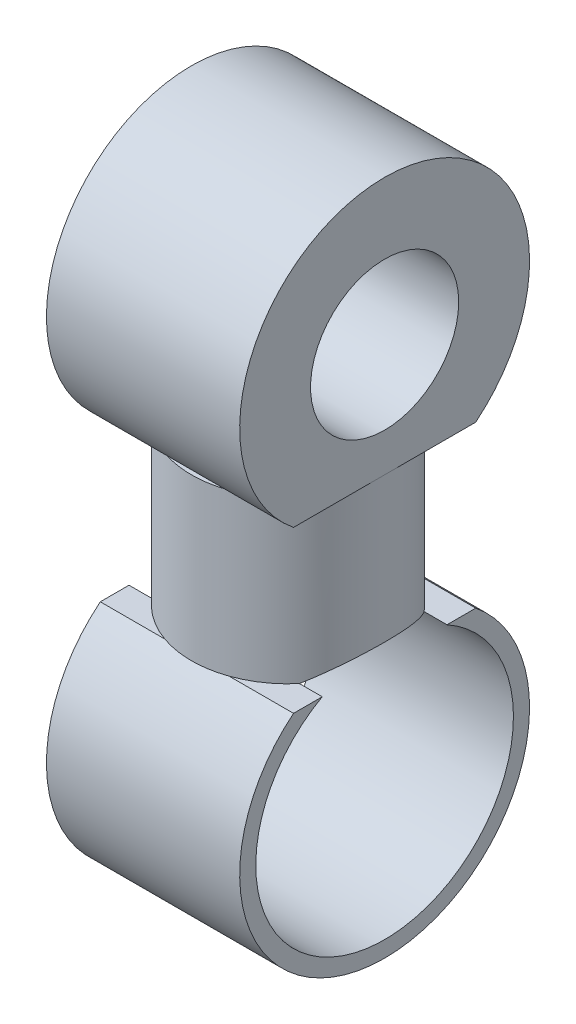
ISO-10303-21;
HEADER;
FILE_DESCRIPTION(('STEP AP214'),'2;1');
FILE_NAME('part.step','',(''),(''),'','','');
FILE_SCHEMA(('AUTOMOTIVE_DESIGN { 1 0 10303 214 1 1 1 1 }'));
ENDSEC;
DATA;
#1=APPLICATION_CONTEXT('core data for automotive mechanical design processes');
#2=APPLICATION_PROTOCOL_DEFINITION('international standard','automotive_design',2000,#1);
#3=PRODUCT_CONTEXT('',#1,'mechanical');
#4=PRODUCT('Part','Part','',(#3));
#5=PRODUCT_RELATED_PRODUCT_CATEGORY('part','',(#4));
#6=PRODUCT_DEFINITION_FORMATION('','',#4);
#7=PRODUCT_DEFINITION_CONTEXT('part definition',#1,'design');
#8=PRODUCT_DEFINITION('design','',#6,#7);
#9=PRODUCT_DEFINITION_SHAPE('','',#8);
#10=(LENGTH_UNIT() NAMED_UNIT(*) SI_UNIT(.MILLI.,.METRE.));
#11=(NAMED_UNIT(*) PLANE_ANGLE_UNIT() SI_UNIT($,.RADIAN.));
#12=(NAMED_UNIT(*) SI_UNIT($,.STERADIAN.) SOLID_ANGLE_UNIT());
#13=UNCERTAINTY_MEASURE_WITH_UNIT(LENGTH_MEASURE(1.E-05),#10,'distance_accuracy_value','');
#14=(GEOMETRIC_REPRESENTATION_CONTEXT(3) GLOBAL_UNCERTAINTY_ASSIGNED_CONTEXT((#13)) GLOBAL_UNIT_ASSIGNED_CONTEXT((#10,
#11,#12)) REPRESENTATION_CONTEXT('',''));
#15=CARTESIAN_POINT('',(0.,0.,0.));
#16=DIRECTION('',(0.,0.,1.));
#17=DIRECTION('',(1.,0.,0.));
#18=AXIS2_PLACEMENT_3D('',#15,#16,#17);
#19=CARTESIAN_POINT('',(0.,4.5,0.));
#20=DIRECTION('',(0.,-1.,0.));
#21=DIRECTION('',(0.,0.,-1.));
#22=AXIS2_PLACEMENT_3D('',#19,#20,#21);
#23=CYLINDRICAL_SURFACE('',#22,3.);
#24=CARTESIAN_POINT('',(0.,5.,0.));
#25=DIRECTION('',(0.,1.,0.));
#26=DIRECTION('',(0.,0.,1.));
#27=AXIS2_PLACEMENT_3D('',#24,#25,#26);
#28=CIRCLE('',#27,3.);
#29=CARTESIAN_POINT('',(-1.,5.,2.82842712474619));
#30=VERTEX_POINT('',#29);
#31=CARTESIAN_POINT('',(1.,5.,2.82842712474619));
#32=VERTEX_POINT('',#31);
#33=EDGE_CURVE('E275',#30,#32,#28,.T.);
#34=ORIENTED_EDGE('',*,*,#33,.F.);
#35=CARTESIAN_POINT('',(-3.,5.,0.));
#36=VERTEX_POINT('',#35);
#37=EDGE_CURVE('E274',#36,#30,#28,.T.);
#38=ORIENTED_EDGE('',*,*,#37,.F.);
#39=CARTESIAN_POINT('',(-0.999999999999999,5.,-2.82842712474619));
#40=VERTEX_POINT('',#39);
#41=EDGE_CURVE('E439',#40,#36,#28,.T.);
#42=ORIENTED_EDGE('',*,*,#41,.F.);
#43=CARTESIAN_POINT('',(0.999999999999999,5.,-2.82842712474619));
#44=VERTEX_POINT('',#43);
#45=EDGE_CURVE('E455',#44,#40,#28,.T.);
#46=ORIENTED_EDGE('',*,*,#45,.F.);
#47=CARTESIAN_POINT('',(3.,5.,0.));
#48=VERTEX_POINT('',#47);
#49=EDGE_CURVE('E452',#48,#44,#28,.T.);
#50=ORIENTED_EDGE('',*,*,#49,.F.);
#51=EDGE_CURVE('E280',#32,#48,#28,.T.);
#52=ORIENTED_EDGE('',*,*,#51,.F.);
#53=EDGE_LOOP('',(#34,#38,#42,#46,#50,#52));
#54=FACE_BOUND('',#53,.T.);
#55=CARTESIAN_POINT('',(0.,0.,0.));
#56=DIRECTION('',(0.,1.,0.));
#57=DIRECTION('',(0.,0.,1.));
#58=AXIS2_PLACEMENT_3D('',#55,#56,#57);
#59=CIRCLE('',#58,3.);
#60=CARTESIAN_POINT('',(-1.,0.,-2.82842712474619));
#61=VERTEX_POINT('',#60);
#62=CARTESIAN_POINT('',(-2.29128784747792,0.,-1.93649167310371));
#63=VERTEX_POINT('',#62);
#64=EDGE_CURVE('E375',#61,#63,#59,.T.);
#65=ORIENTED_EDGE('',*,*,#64,.T.);
#66=CARTESIAN_POINT('',(-2.29128784747792,0.,-1.93649167310371));
#67=CARTESIAN_POINT('',(-2.33960531215162,0.031637684202628,-1.87930069137875));
#68=CARTESIAN_POINT('',(-2.38597131135707,0.0625560228296738,-1.82011345106026));
#69=CARTESIAN_POINT('',(-2.47456837017257,0.122487190395126,-1.69772026656292));
#70=CARTESIAN_POINT('',(-2.51679564090104,0.151498265439313,-1.63451072578697));
#71=CARTESIAN_POINT('',(-2.63733345868187,0.235259035748146,-1.43809158975917));
#72=CARTESIAN_POINT('',(-2.7088400381469,0.286295652024037,-1.29886379495034));
#73=CARTESIAN_POINT('',(-2.80007305597204,0.352268852673703,-1.07978407452648));
#74=CARTESIAN_POINT('',(-2.82788241411722,0.372548958473154,-1.00476793971611));
#75=CARTESIAN_POINT('',(-2.87763310974862,0.409025907601418,-0.851866817398749));
#76=CARTESIAN_POINT('',(-2.89957788437755,0.425225142345652,-0.773983540869725));
#77=CARTESIAN_POINT('',(-2.93715260815061,0.453062923120266,-0.61618812070086));
#78=CARTESIAN_POINT('',(-2.95280354213411,0.464716620845895,-0.536283679439771));
#79=CARTESIAN_POINT('',(-2.97759668037431,0.483216871465038,-0.374953499743338));
#80=CARTESIAN_POINT('',(-2.9867400017866,0.490064249452066,-0.293528024886594));
#81=CARTESIAN_POINT('',(-3.00265802713564,0.501985739416292,-0.0682216055642268));
#82=CARTESIAN_POINT('',(-3.00246757367103,0.501844121811212,0.0765296087037328));
#83=CARTESIAN_POINT('',(-2.98136614380672,0.486038323811593,0.363622730617651));
#84=CARTESIAN_POINT('',(-2.96044575673277,0.470367093508772,0.505963514161905));
#85=CARTESIAN_POINT('',(-2.90094101757758,0.426205152013952,0.776301877948906));
#86=CARTESIAN_POINT('',(-2.86339567813845,0.398469984753027,0.904657470071963));
#87=CARTESIAN_POINT('',(-2.77276308620056,0.332395789663157,1.15294171807456));
#88=CARTESIAN_POINT('',(-2.71966111318218,0.294046720299558,1.27286225835994));
#89=CARTESIAN_POINT('',(-2.6077506418834,0.21470083465322,1.487385036329));
#90=CARTESIAN_POINT('',(-2.5506026890119,0.174710086605101,1.58324548346381));
#91=CARTESIAN_POINT('',(-2.4273823637667,0.0902974630640805,1.76633137546215));
#92=CARTESIAN_POINT('',(-2.36134643128432,0.0458938647540437,1.85358968213791));
#93=CARTESIAN_POINT('',(-2.29128784747792,0.,1.93649167310371));
#94=B_SPLINE_CURVE_WITH_KNOTS('',3,(#66,#67,#68,#69,#70,#71,#72,#73,#74,#75,#76,#77,#78,#79,#80,
#81,#82,#83,#84,#85,#86,#87,#88,#89,#90,#91,#92,#93),.UNSPECIFIED.,.F.,.F.,(4,2,2,2,2,2,2,2,2,2,
2,2,2,4),(0.,0.243702912554063,0.487626883775307,0.978764179619406,1.22608572911403,
1.47326200775075,1.71960718199239,1.96591005618742,2.39763691228655,2.82955984730584,
3.2376359542357,3.64609945879512,4.00101870034537,4.35452477848348),.UNSPECIFIED.);
#95=CARTESIAN_POINT('',(-2.29128784747792,0.,1.93649167310371));
#96=VERTEX_POINT('',#95);
#97=EDGE_CURVE('E253',#63,#96,#94,.T.);
#98=ORIENTED_EDGE('',*,*,#97,.T.);
#99=CARTESIAN_POINT('',(-1.,0.,2.82842712474619));
#100=VERTEX_POINT('',#99);
#101=EDGE_CURVE('E251',#96,#100,#59,.T.);
#102=ORIENTED_EDGE('',*,*,#101,.T.);
#103=CARTESIAN_POINT('',(0.,0.,0.));
#104=DIRECTION('',(0.,1.,0.));
#105=DIRECTION('',(0.,0.,1.));
#106=AXIS2_PLACEMENT_3D('',#103,#104,#105);
#107=CIRCLE('',#106,3.);
#108=CARTESIAN_POINT('',(1.,0.,2.82842712474619));
#109=VERTEX_POINT('',#108);
#110=EDGE_CURVE('E333',#100,#109,#107,.T.);
#111=ORIENTED_EDGE('',*,*,#110,.T.);
#112=CARTESIAN_POINT('',(2.29128784747792,0.,1.93649167310371));
#113=VERTEX_POINT('',#112);
#114=EDGE_CURVE('E267',#109,#113,#59,.T.);
#115=ORIENTED_EDGE('',*,*,#114,.T.);
#116=CARTESIAN_POINT('',(2.29128784747792,0.,1.93649167310371));
#117=CARTESIAN_POINT('',(2.33960531215162,0.0316376842026277,1.87930069137875));
#118=CARTESIAN_POINT('',(2.38597131135707,0.0625560228296734,1.82011345106026));
#119=CARTESIAN_POINT('',(2.47456837017257,0.122487190395126,1.69772026656292));
#120=CARTESIAN_POINT('',(2.51679564090104,0.151498265439312,1.63451072578697));
#121=CARTESIAN_POINT('',(2.63733345868187,0.235259035748145,1.43809158975917));
#122=CARTESIAN_POINT('',(2.7088400381469,0.286295652024036,1.29886379495034));
#123=CARTESIAN_POINT('',(2.80007305597204,0.352268852673702,1.07978407452648));
#124=CARTESIAN_POINT('',(2.82788241411722,0.372548958473153,1.00476793971611));
#125=CARTESIAN_POINT('',(2.87763310974862,0.409025907601417,0.851866817398749));
#126=CARTESIAN_POINT('',(2.89957788437755,0.425225142345652,0.773983540869725));
#127=CARTESIAN_POINT('',(2.93715260815061,0.453062923120266,0.61618812070086));
#128=CARTESIAN_POINT('',(2.95280354213411,0.464716620845894,0.536283679439771));
#129=CARTESIAN_POINT('',(2.97759668037431,0.483216871465037,0.374953499743338));
#130=CARTESIAN_POINT('',(2.9867400017866,0.490064249452066,0.293528024886594));
#131=CARTESIAN_POINT('',(3.00265802713564,0.501985739416293,0.068221605564227));
#132=CARTESIAN_POINT('',(3.00246757367103,0.501844121811212,-0.0765296087037324));
#133=CARTESIAN_POINT('',(2.98136614380672,0.486038323811593,-0.363622730617651));
#134=CARTESIAN_POINT('',(2.96044575673277,0.470367093508772,-0.505963514161905));
#135=CARTESIAN_POINT('',(2.90094101757758,0.426205152013952,-0.776301877948906));
#136=CARTESIAN_POINT('',(2.86339567813845,0.398469984753027,-0.904657470071963));
#137=CARTESIAN_POINT('',(2.77276308620056,0.332395789663157,-1.15294171807456));
#138=CARTESIAN_POINT('',(2.71966111318218,0.294046720299557,-1.27286225835994));
#139=CARTESIAN_POINT('',(2.6077506418834,0.21470083465322,-1.487385036329));
#140=CARTESIAN_POINT('',(2.5506026890119,0.174710086605101,-1.58324548346381));
#141=CARTESIAN_POINT('',(2.4273823637667,0.0902974630640802,-1.76633137546214));
#142=CARTESIAN_POINT('',(2.36134643128432,0.0458938647540435,-1.85358968213791));
#143=CARTESIAN_POINT('',(2.29128784747792,0.,-1.93649167310371));
#144=B_SPLINE_CURVE_WITH_KNOTS('',3,(#116,#117,#118,#119,#120,#121,#122,#123,#124,#125,#126,
#127,#128,#129,#130,#131,#132,#133,#134,#135,#136,#137,#138,#139,#140,#141,#142,#143),
.UNSPECIFIED.,.F.,.F.,(4,2,2,2,2,2,2,2,2,2,2,2,2,4),(0.,0.243702912554063,0.487626883775307,
0.978764179619406,1.22608572911403,1.47326200775075,1.71960718199238,1.96591005618742,
2.39763691228655,2.82955984730584,3.2376359542357,3.64609945879512,4.00101870034537,
4.35452477848348),.UNSPECIFIED.);
#145=CARTESIAN_POINT('',(2.29128784747792,0.,-1.93649167310371));
#146=VERTEX_POINT('',#145);
#147=EDGE_CURVE('E381',#113,#146,#144,.T.);
#148=ORIENTED_EDGE('',*,*,#147,.T.);
#149=CARTESIAN_POINT('',(1.,0.,-2.82842712474619));
#150=VERTEX_POINT('',#149);
#151=EDGE_CURVE('E269',#146,#150,#59,.T.);
#152=ORIENTED_EDGE('',*,*,#151,.T.);
#153=EDGE_CURVE('E371',#150,#61,#59,.T.);
#154=ORIENTED_EDGE('',*,*,#153,.T.);
#155=EDGE_LOOP('',(#65,#98,#102,#111,#115,#148,#152,#154));
#156=FACE_BOUND('',#155,.T.);
#157=ADVANCED_FACE('F143',(#54,#156),#23,.T.);
#158=CARTESIAN_POINT('',(0.,5.,0.));
#159=DIRECTION('',(0.,1.,0.));
#160=DIRECTION('',(0.,0.,1.));
#161=AXIS2_PLACEMENT_3D('',#158,#159,#160);
#162=PLANE('',#161);
#163=DIRECTION('',(1.,0.,0.));
#164=VECTOR('',#163,1.);
#165=CARTESIAN_POINT('',(-3.,5.,-2.82842712474619));
#166=LINE('',#165,#164);
#167=CARTESIAN_POINT('',(-3.,5.,-2.82842712474619));
#168=VERTEX_POINT('',#167);
#169=EDGE_CURVE('E309',#168,#40,#166,.T.);
#170=ORIENTED_EDGE('',*,*,#169,.T.);
#171=ORIENTED_EDGE('',*,*,#41,.T.);
#172=DIRECTION('',(0.,0.,1.));
#173=VECTOR('',#172,1.);
#174=CARTESIAN_POINT('',(-3.,5.,0.));
#175=LINE('',#174,#173);
#176=EDGE_CURVE('E287',#168,#36,#175,.T.);
#177=ORIENTED_EDGE('',*,*,#176,.F.);
#178=EDGE_LOOP('',(#170,#171,#177));
#179=FACE_BOUND('',#178,.T.);
#180=ADVANCED_FACE('F419',(#179),#162,.F.);
#181=DIRECTION('',(1.,0.,0.));
#182=VECTOR('',#181,1.);
#183=CARTESIAN_POINT('',(-3.,5.,2.82842712474619));
#184=LINE('',#183,#182);
#185=CARTESIAN_POINT('',(-3.,5.,2.82842712474619));
#186=VERTEX_POINT('',#185);
#187=EDGE_CURVE('E318',#186,#30,#184,.T.);
#188=ORIENTED_EDGE('',*,*,#187,.F.);
#189=EDGE_CURVE('E285',#36,#186,#175,.T.);
#190=ORIENTED_EDGE('',*,*,#189,.F.);
#191=ORIENTED_EDGE('',*,*,#37,.T.);
#192=EDGE_LOOP('',(#188,#190,#191));
#193=FACE_BOUND('',#192,.T.);
#194=ADVANCED_FACE('F424',(#193),#162,.F.);
#195=DIRECTION('',(1.,0.,0.));
#196=VECTOR('',#195,1.);
#197=CARTESIAN_POINT('',(-3.,5.,2.82842712474619));
#198=LINE('',#197,#196);
#199=CARTESIAN_POINT('',(3.,5.,2.82842712474619));
#200=VERTEX_POINT('',#199);
#201=EDGE_CURVE('E291',#200,#32,#198,.F.);
#202=ORIENTED_EDGE('',*,*,#201,.T.);
#203=ORIENTED_EDGE('',*,*,#51,.T.);
#204=DIRECTION('',(0.,0.,1.));
#205=VECTOR('',#204,1.);
#206=CARTESIAN_POINT('',(3.,5.,0.));
#207=LINE('',#206,#205);
#208=EDGE_CURVE('E286',#48,#200,#207,.T.);
#209=ORIENTED_EDGE('',*,*,#208,.T.);
#210=EDGE_LOOP('',(#202,#203,#209));
#211=FACE_BOUND('',#210,.T.);
#212=ADVANCED_FACE('F496',(#211),#162,.F.);
#213=CARTESIAN_POINT('',(3.,5.,-2.82842712474619));
#214=VERTEX_POINT('',#213);
#215=EDGE_CURVE('E281',#214,#48,#207,.T.);
#216=ORIENTED_EDGE('',*,*,#215,.T.);
#217=ORIENTED_EDGE('',*,*,#49,.T.);
#218=DIRECTION('',(1.,0.,0.));
#219=VECTOR('',#218,1.);
#220=CARTESIAN_POINT('',(-3.,5.,-2.82842712474619));
#221=LINE('',#220,#219);
#222=EDGE_CURVE('E279',#44,#214,#221,.T.);
#223=ORIENTED_EDGE('',*,*,#222,.T.);
#224=EDGE_LOOP('',(#216,#217,#223));
#225=FACE_BOUND('',#224,.T.);
#226=ADVANCED_FACE('F427',(#225),#162,.F.);
#227=CARTESIAN_POINT('',(-3.,8.5,0.));
#228=DIRECTION('',(1.,0.,0.));
#229=DIRECTION('',(0.,0.,-1.));
#230=AXIS2_PLACEMENT_3D('',#227,#228,#229);
#231=CYLINDRICAL_SURFACE('',#230,2.3);
#232=CARTESIAN_POINT('',(-3.,8.5,0.));
#233=DIRECTION('',(1.,0.,0.));
#234=DIRECTION('',(0.,0.,-1.));
#235=AXIS2_PLACEMENT_3D('',#232,#233,#234);
#236=CIRCLE('',#235,2.3);
#237=CARTESIAN_POINT('',(-3.,8.5,-2.3));
#238=VERTEX_POINT('',#237);
#239=EDGE_CURVE('E297',#238,#238,#236,.T.);
#240=ORIENTED_EDGE('',*,*,#239,.F.);
#241=EDGE_LOOP('',(#240));
#242=FACE_BOUND('',#241,.T.);
#243=CARTESIAN_POINT('',(3.,8.5,0.));
#244=DIRECTION('',(1.,0.,0.));
#245=DIRECTION('',(0.,0.,-1.));
#246=AXIS2_PLACEMENT_3D('',#243,#244,#245);
#247=CIRCLE('',#246,2.3);
#248=CARTESIAN_POINT('',(3.,8.5,-2.3));
#249=VERTEX_POINT('',#248);
#250=EDGE_CURVE('E296',#249,#249,#247,.T.);
#251=ORIENTED_EDGE('',*,*,#250,.T.);
#252=EDGE_LOOP('',(#251));
#253=FACE_BOUND('',#252,.T.);
#254=ADVANCED_FACE('F465',(#242,#253),#231,.F.);
#255=CARTESIAN_POINT('',(3.,5.,0.));
#256=DIRECTION('',(0.,1.,0.));
#257=DIRECTION('',(0.,0.,1.));
#258=AXIS2_PLACEMENT_3D('',#255,#256,#257);
#259=PLANE('',#258);
#260=ORIENTED_EDGE('',*,*,#45,.T.);
#261=EDGE_CURVE('E308',#40,#44,#166,.T.);
#262=ORIENTED_EDGE('',*,*,#261,.T.);
#263=EDGE_LOOP('',(#260,#262));
#264=FACE_BOUND('',#263,.T.);
#265=ADVANCED_FACE('F462',(#264),#259,.T.);
#266=CARTESIAN_POINT('',(3.,0.,0.));
#267=DIRECTION('',(1.,0.,0.));
#268=DIRECTION('',(0.,0.,-1.));
#269=AXIS2_PLACEMENT_3D('',#266,#267,#268);
#270=PLANE('',#269);
#271=ORIENTED_EDGE('',*,*,#215,.F.);
#272=CARTESIAN_POINT('',(3.,8.5,0.));
#273=DIRECTION('',(1.,0.,0.));
#274=DIRECTION('',(0.,0.,-1.));
#275=AXIS2_PLACEMENT_3D('',#272,#273,#274);
#276=CIRCLE('',#275,4.5);
#277=EDGE_CURVE('E301',#214,#200,#276,.T.);
#278=ORIENTED_EDGE('',*,*,#277,.T.);
#279=ORIENTED_EDGE('',*,*,#208,.F.);
#280=EDGE_LOOP('',(#271,#278,#279));
#281=FACE_BOUND('',#280,.T.);
#282=ORIENTED_EDGE('',*,*,#250,.F.);
#283=EDGE_LOOP('',(#282));
#284=FACE_BOUND('',#283,.T.);
#285=ADVANCED_FACE('F464',(#281,#284),#270,.T.);
#286=CARTESIAN_POINT('',(-3.,0.,0.));
#287=DIRECTION('',(1.,0.,0.));
#288=DIRECTION('',(0.,0.,-1.));
#289=AXIS2_PLACEMENT_3D('',#286,#287,#288);
#290=PLANE('',#289);
#291=ORIENTED_EDGE('',*,*,#239,.T.);
#292=EDGE_LOOP('',(#291));
#293=FACE_BOUND('',#292,.T.);
#294=CARTESIAN_POINT('',(-3.,8.5,0.));
#295=DIRECTION('',(1.,0.,0.));
#296=DIRECTION('',(0.,0.,-1.));
#297=AXIS2_PLACEMENT_3D('',#294,#295,#296);
#298=CIRCLE('',#297,4.5);
#299=EDGE_CURVE('E313',#168,#186,#298,.T.);
#300=ORIENTED_EDGE('',*,*,#299,.F.);
#301=ORIENTED_EDGE('',*,*,#176,.T.);
#302=ORIENTED_EDGE('',*,*,#189,.T.);
#303=EDGE_LOOP('',(#300,#301,#302));
#304=FACE_BOUND('',#303,.T.);
#305=ADVANCED_FACE('F447',(#293,#304),#290,.F.);
#306=CARTESIAN_POINT('',(-3.,8.5,0.));
#307=DIRECTION('',(1.,0.,0.));
#308=DIRECTION('',(0.,0.,-1.));
#309=AXIS2_PLACEMENT_3D('',#306,#307,#308);
#310=CYLINDRICAL_SURFACE('',#309,4.5);
#311=ORIENTED_EDGE('',*,*,#169,.F.);
#312=ORIENTED_EDGE('',*,*,#299,.T.);
#313=ORIENTED_EDGE('',*,*,#187,.T.);
#314=EDGE_CURVE('E317',#30,#32,#184,.T.);
#315=ORIENTED_EDGE('',*,*,#314,.T.);
#316=ORIENTED_EDGE('',*,*,#201,.F.);
#317=ORIENTED_EDGE('',*,*,#277,.F.);
#318=ORIENTED_EDGE('',*,*,#222,.F.);
#319=ORIENTED_EDGE('',*,*,#261,.F.);
#320=EDGE_LOOP('',(#311,#312,#313,#315,#316,#317,#318,#319));
#321=FACE_BOUND('',#320,.T.);
#322=ADVANCED_FACE('F414',(#321),#310,.T.);
#323=CARTESIAN_POINT('',(-3.,5.,0.));
#324=DIRECTION('',(0.,-1.,0.));
#325=DIRECTION('',(0.,0.,-1.));
#326=AXIS2_PLACEMENT_3D('',#323,#324,#325);
#327=PLANE('',#326);
#328=ORIENTED_EDGE('',*,*,#314,.F.);
#329=ORIENTED_EDGE('',*,*,#33,.T.);
#330=EDGE_LOOP('',(#328,#329));
#331=FACE_BOUND('',#330,.T.);
#332=ADVANCED_FACE('F409',(#331),#327,.F.);
#333=CARTESIAN_POINT('',(0.,0.,0.));
#334=DIRECTION('',(0.,-1.,0.));
#335=DIRECTION('',(0.,0.,-1.));
#336=AXIS2_PLACEMENT_3D('',#333,#334,#335);
#337=PLANE('',#336);
#338=DIRECTION('',(0.,0.,-1.));
#339=VECTOR('',#338,1.);
#340=CARTESIAN_POINT('',(-3.,0.,0.));
#341=LINE('',#340,#339);
#342=CARTESIAN_POINT('',(-3.,0.,-1.93649167310371));
#343=VERTEX_POINT('',#342);
#344=CARTESIAN_POINT('',(-3.,0.,-2.82842712474619));
#345=VERTEX_POINT('',#344);
#346=EDGE_CURVE('E261',#343,#345,#341,.T.);
#347=ORIENTED_EDGE('',*,*,#346,.F.);
#348=DIRECTION('',(1.,0.,0.));
#349=VECTOR('',#348,1.);
#350=CARTESIAN_POINT('',(-3.,0.,-1.93649167310371));
#351=LINE('',#350,#349);
#352=EDGE_CURVE('E159',#343,#63,#351,.T.);
#353=ORIENTED_EDGE('',*,*,#352,.T.);
#354=ORIENTED_EDGE('',*,*,#64,.F.);
#355=DIRECTION('',(1.,0.,0.));
#356=VECTOR('',#355,1.);
#357=CARTESIAN_POINT('',(-3.,0.,-2.82842712474619));
#358=LINE('',#357,#356);
#359=EDGE_CURVE('E323',#345,#61,#358,.T.);
#360=ORIENTED_EDGE('',*,*,#359,.F.);
#361=EDGE_LOOP('',(#347,#353,#354,#360));
#362=FACE_BOUND('',#361,.T.);
#363=ADVANCED_FACE('F394',(#362),#337,.F.);
#364=ORIENTED_EDGE('',*,*,#151,.F.);
#365=DIRECTION('',(1.,0.,0.));
#366=VECTOR('',#365,1.);
#367=CARTESIAN_POINT('',(-3.,0.,-1.93649167310371));
#368=LINE('',#367,#366);
#369=CARTESIAN_POINT('',(3.,0.,-1.93649167310371));
#370=VERTEX_POINT('',#369);
#371=EDGE_CURVE('E379',#146,#370,#368,.T.);
#372=ORIENTED_EDGE('',*,*,#371,.T.);
#373=DIRECTION('',(0.,0.,-1.));
#374=VECTOR('',#373,1.);
#375=CARTESIAN_POINT('',(3.,0.,0.));
#376=LINE('',#375,#374);
#377=CARTESIAN_POINT('',(3.,0.,-2.82842712474619));
#378=VERTEX_POINT('',#377);
#379=EDGE_CURVE('E336',#370,#378,#376,.T.);
#380=ORIENTED_EDGE('',*,*,#379,.T.);
#381=EDGE_CURVE('E322',#150,#378,#358,.T.);
#382=ORIENTED_EDGE('',*,*,#381,.F.);
#383=EDGE_LOOP('',(#364,#372,#380,#382));
#384=FACE_BOUND('',#383,.T.);
#385=ADVANCED_FACE('F408',(#384),#337,.F.);
#386=CARTESIAN_POINT('',(3.,0.,2.82842712474619));
#387=VERTEX_POINT('',#386);
#388=CARTESIAN_POINT('',(3.,0.,1.93649167310371));
#389=VERTEX_POINT('',#388);
#390=EDGE_CURVE('E152',#387,#389,#376,.T.);
#391=ORIENTED_EDGE('',*,*,#390,.T.);
#392=DIRECTION('',(1.,0.,0.));
#393=VECTOR('',#392,1.);
#394=CARTESIAN_POINT('',(-3.,0.,1.93649167310371));
#395=LINE('',#394,#393);
#396=EDGE_CURVE('E166',#389,#113,#395,.F.);
#397=ORIENTED_EDGE('',*,*,#396,.T.);
#398=ORIENTED_EDGE('',*,*,#114,.F.);
#399=DIRECTION('',(1.,0.,0.));
#400=VECTOR('',#399,1.);
#401=CARTESIAN_POINT('',(-3.,0.,2.82842712474619));
#402=LINE('',#401,#400);
#403=EDGE_CURVE('E329',#387,#109,#402,.F.);
#404=ORIENTED_EDGE('',*,*,#403,.F.);
#405=EDGE_LOOP('',(#391,#397,#398,#404));
#406=FACE_BOUND('',#405,.T.);
#407=ADVANCED_FACE('F347',(#406),#337,.F.);
#408=ORIENTED_EDGE('',*,*,#101,.F.);
#409=DIRECTION('',(1.,0.,0.));
#410=VECTOR('',#409,1.);
#411=CARTESIAN_POINT('',(-3.,0.,1.93649167310371));
#412=LINE('',#411,#410);
#413=CARTESIAN_POINT('',(-3.,0.,1.93649167310371));
#414=VERTEX_POINT('',#413);
#415=EDGE_CURVE('E239',#96,#414,#412,.F.);
#416=ORIENTED_EDGE('',*,*,#415,.T.);
#417=CARTESIAN_POINT('',(-3.,0.,2.82842712474619));
#418=VERTEX_POINT('',#417);
#419=EDGE_CURVE('E249',#418,#414,#341,.T.);
#420=ORIENTED_EDGE('',*,*,#419,.F.);
#421=EDGE_CURVE('E327',#100,#418,#402,.F.);
#422=ORIENTED_EDGE('',*,*,#421,.F.);
#423=EDGE_LOOP('',(#408,#416,#420,#422));
#424=FACE_BOUND('',#423,.T.);
#425=ADVANCED_FACE('F247',(#424),#337,.F.);
#426=CARTESIAN_POINT('',(-3.,5.,0.));
#427=DIRECTION('',(1.,0.,0.));
#428=DIRECTION('',(0.,0.,-1.));
#429=AXIS2_PLACEMENT_3D('',#426,#427,#428);
#430=PLANE('',#429);
#431=ORIENTED_EDGE('',*,*,#419,.T.);
#432=CARTESIAN_POINT('',(-3.,-3.5,0.));
#433=DIRECTION('',(1.,0.,0.));
#434=DIRECTION('',(0.,0.,-1.));
#435=AXIS2_PLACEMENT_3D('',#432,#433,#434);
#436=CIRCLE('',#435,4.);
#437=EDGE_CURVE('E236',#414,#343,#436,.T.);
#438=ORIENTED_EDGE('',*,*,#437,.T.);
#439=ORIENTED_EDGE('',*,*,#346,.T.);
#440=CARTESIAN_POINT('',(-3.,-3.5,0.));
#441=DIRECTION('',(-1.,0.,0.));
#442=DIRECTION('',(0.,0.,-1.));
#443=AXIS2_PLACEMENT_3D('',#440,#441,#442);
#444=CIRCLE('',#443,4.5);
#445=EDGE_CURVE('E258',#345,#418,#444,.T.);
#446=ORIENTED_EDGE('',*,*,#445,.T.);
#447=EDGE_LOOP('',(#431,#438,#439,#446));
#448=FACE_BOUND('',#447,.T.);
#449=ADVANCED_FACE('F256',(#448),#430,.F.);
#450=CARTESIAN_POINT('',(0.,0.,0.));
#451=DIRECTION('',(0.,1.,0.));
#452=DIRECTION('',(0.,0.,1.));
#453=AXIS2_PLACEMENT_3D('',#450,#451,#452);
#454=PLANE('',#453);
#455=EDGE_CURVE('E334',#109,#100,#402,.F.);
#456=ORIENTED_EDGE('',*,*,#455,.F.);
#457=ORIENTED_EDGE('',*,*,#110,.F.);
#458=EDGE_LOOP('',(#456,#457));
#459=FACE_BOUND('',#458,.T.);
#460=ADVANCED_FACE('F366',(#459),#454,.F.);
#461=CARTESIAN_POINT('',(3.,5.,0.));
#462=DIRECTION('',(1.,0.,0.));
#463=DIRECTION('',(0.,0.,-1.));
#464=AXIS2_PLACEMENT_3D('',#461,#462,#463);
#465=PLANE('',#464);
#466=CARTESIAN_POINT('',(3.,-3.5,0.));
#467=DIRECTION('',(1.,0.,0.));
#468=DIRECTION('',(0.,0.,-1.));
#469=AXIS2_PLACEMENT_3D('',#466,#467,#468);
#470=CIRCLE('',#469,4.);
#471=EDGE_CURVE('E13',#389,#370,#470,.T.);
#472=ORIENTED_EDGE('',*,*,#471,.F.);
#473=ORIENTED_EDGE('',*,*,#390,.F.);
#474=CARTESIAN_POINT('',(3.,-3.5,0.));
#475=DIRECTION('',(-1.,0.,0.));
#476=DIRECTION('',(0.,0.,-1.));
#477=AXIS2_PLACEMENT_3D('',#474,#475,#476);
#478=CIRCLE('',#477,4.5);
#479=EDGE_CURVE('E260',#378,#387,#478,.T.);
#480=ORIENTED_EDGE('',*,*,#479,.F.);
#481=ORIENTED_EDGE('',*,*,#379,.F.);
#482=EDGE_LOOP('',(#472,#473,#480,#481));
#483=FACE_BOUND('',#482,.T.);
#484=ADVANCED_FACE('F352',(#483),#465,.T.);
#485=ORIENTED_EDGE('',*,*,#153,.F.);
#486=EDGE_CURVE('E328',#61,#150,#358,.T.);
#487=ORIENTED_EDGE('',*,*,#486,.F.);
#488=EDGE_LOOP('',(#485,#487));
#489=FACE_BOUND('',#488,.T.);
#490=ADVANCED_FACE('F480',(#489),#454,.F.);
#491=CARTESIAN_POINT('',(-3.,-3.5,0.));
#492=DIRECTION('',(1.,0.,0.));
#493=DIRECTION('',(0.,0.,-1.));
#494=AXIS2_PLACEMENT_3D('',#491,#492,#493);
#495=CYLINDRICAL_SURFACE('',#494,4.5);
#496=ORIENTED_EDGE('',*,*,#359,.T.);
#497=ORIENTED_EDGE('',*,*,#486,.T.);
#498=ORIENTED_EDGE('',*,*,#381,.T.);
#499=ORIENTED_EDGE('',*,*,#479,.T.);
#500=ORIENTED_EDGE('',*,*,#403,.T.);
#501=ORIENTED_EDGE('',*,*,#455,.T.);
#502=ORIENTED_EDGE('',*,*,#421,.T.);
#503=ORIENTED_EDGE('',*,*,#445,.F.);
#504=EDGE_LOOP('',(#496,#497,#498,#499,#500,#501,#502,#503));
#505=FACE_BOUND('',#504,.T.);
#506=ADVANCED_FACE('F354',(#505),#495,.T.);
#507=CARTESIAN_POINT('',(-3.,-3.5,0.));
#508=DIRECTION('',(1.,0.,0.));
#509=DIRECTION('',(0.,0.,-1.));
#510=AXIS2_PLACEMENT_3D('',#507,#508,#509);
#511=CYLINDRICAL_SURFACE('',#510,4.);
#512=ORIENTED_EDGE('',*,*,#437,.F.);
#513=ORIENTED_EDGE('',*,*,#415,.F.);
#514=ORIENTED_EDGE('',*,*,#97,.F.);
#515=ORIENTED_EDGE('',*,*,#352,.F.);
#516=EDGE_LOOP('',(#512,#513,#514,#515));
#517=FACE_BOUND('',#516,.T.);
#518=ORIENTED_EDGE('',*,*,#147,.F.);
#519=ORIENTED_EDGE('',*,*,#396,.F.);
#520=ORIENTED_EDGE('',*,*,#471,.T.);
#521=ORIENTED_EDGE('',*,*,#371,.F.);
#522=EDGE_LOOP('',(#518,#519,#520,#521));
#523=FACE_BOUND('',#522,.T.);
#524=ADVANCED_FACE('F238',(#517,#523),#511,.F.);
#525=CLOSED_SHELL('',(#157,#180,#194,#212,#226,#254,#265,#285,#305,#322,#332,#363,#385,#407,
#425,#449,#460,#484,#490,#506,#524));
#526=MANIFOLD_SOLID_BREP('B2',#525);
#527=ADVANCED_BREP_SHAPE_REPRESENTATION('',(#18,#526),#14);
#528=SHAPE_DEFINITION_REPRESENTATION(#9,#527);
ENDSEC;
END-ISO-10303-21;
